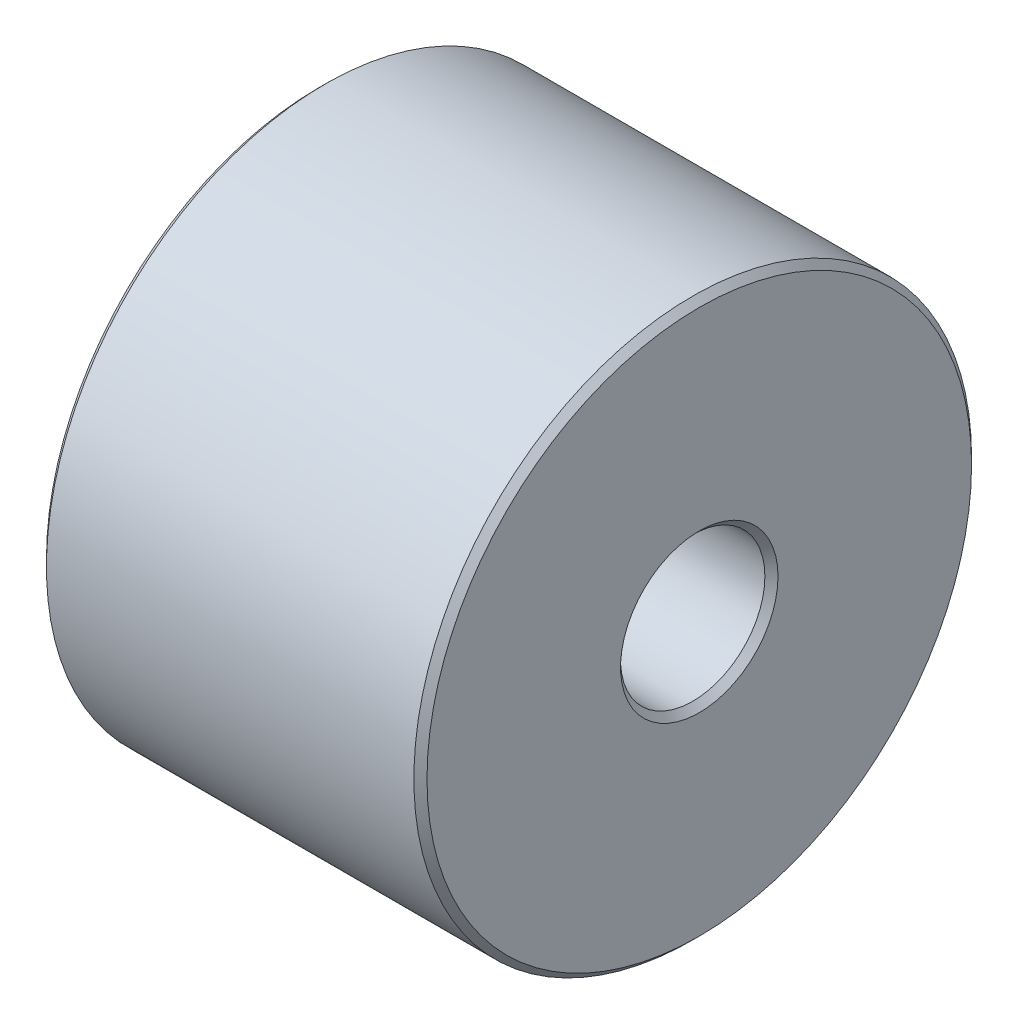
ISO-10303-21;
HEADER;
FILE_DESCRIPTION(('STEP AP214'),'2;1');
FILE_NAME('part.step','',(''),(''),'','','');
FILE_SCHEMA(('AUTOMOTIVE_DESIGN { 1 0 10303 214 1 1 1 1 }'));
ENDSEC;
DATA;
#1=APPLICATION_CONTEXT('core data for automotive mechanical design processes');
#2=APPLICATION_PROTOCOL_DEFINITION('international standard','automotive_design',2000,#1);
#3=PRODUCT_CONTEXT('',#1,'mechanical');
#4=PRODUCT('Part','Part','',(#3));
#5=PRODUCT_RELATED_PRODUCT_CATEGORY('part','',(#4));
#6=PRODUCT_DEFINITION_FORMATION('','',#4);
#7=PRODUCT_DEFINITION_CONTEXT('part definition',#1,'design');
#8=PRODUCT_DEFINITION('design','',#6,#7);
#9=PRODUCT_DEFINITION_SHAPE('','',#8);
#10=(LENGTH_UNIT() NAMED_UNIT(*) SI_UNIT(.MILLI.,.METRE.));
#11=(NAMED_UNIT(*) PLANE_ANGLE_UNIT() SI_UNIT($,.RADIAN.));
#12=(NAMED_UNIT(*) SI_UNIT($,.STERADIAN.) SOLID_ANGLE_UNIT());
#13=UNCERTAINTY_MEASURE_WITH_UNIT(LENGTH_MEASURE(1.E-05),#10,'distance_accuracy_value','');
#14=(GEOMETRIC_REPRESENTATION_CONTEXT(3) GLOBAL_UNCERTAINTY_ASSIGNED_CONTEXT((#13)) GLOBAL_UNIT_ASSIGNED_CONTEXT((#10,
#11,#12)) REPRESENTATION_CONTEXT('',''));
#15=CARTESIAN_POINT('',(0.,0.,0.));
#16=DIRECTION('',(0.,0.,1.));
#17=DIRECTION('',(1.,0.,0.));
#18=AXIS2_PLACEMENT_3D('',#15,#16,#17);
#19=CARTESIAN_POINT('',(11.6,0.,0.));
#20=DIRECTION('',(1.,0.,0.));
#21=DIRECTION('',(0.,0.,-1.));
#22=AXIS2_PLACEMENT_3D('',#19,#20,#21);
#23=PLANE('',#22);
#24=CARTESIAN_POINT('',(11.6,0.,0.));
#25=DIRECTION('',(1.,0.,0.));
#26=DIRECTION('',(0.,0.,-1.));
#27=AXIS2_PLACEMENT_3D('',#24,#25,#26);
#28=CIRCLE('',#27,8.3);
#29=CARTESIAN_POINT('',(11.6,0.,-8.3));
#30=VERTEX_POINT('',#29);
#31=EDGE_CURVE('E59',#30,#30,#28,.T.);
#32=ORIENTED_EDGE('',*,*,#31,.T.);
#33=EDGE_LOOP('',(#32));
#34=FACE_BOUND('',#33,.T.);
#35=CARTESIAN_POINT('',(11.6,0.,0.));
#36=DIRECTION('',(1.,0.,0.));
#37=DIRECTION('',(0.,0.,-1.));
#38=AXIS2_PLACEMENT_3D('',#35,#36,#37);
#39=CIRCLE('',#38,2.4);
#40=CARTESIAN_POINT('',(11.6,0.,-2.4));
#41=VERTEX_POINT('',#40);
#42=EDGE_CURVE('E62',#41,#41,#39,.F.);
#43=ORIENTED_EDGE('',*,*,#42,.T.);
#44=EDGE_LOOP('',(#43));
#45=FACE_BOUND('',#44,.T.);
#46=ADVANCED_FACE('F33',(#34,#45),#23,.T.);
#47=CARTESIAN_POINT('',(0.,0.,0.));
#48=DIRECTION('',(1.,0.,0.));
#49=DIRECTION('',(0.,0.,-1.));
#50=AXIS2_PLACEMENT_3D('',#47,#48,#49);
#51=PLANE('',#50);
#52=CARTESIAN_POINT('',(0.,0.,0.));
#53=DIRECTION('',(1.,0.,0.));
#54=DIRECTION('',(0.,0.,-1.));
#55=AXIS2_PLACEMENT_3D('',#52,#53,#54);
#56=CIRCLE('',#55,8.3);
#57=CARTESIAN_POINT('',(0.,0.,-8.3));
#58=VERTEX_POINT('',#57);
#59=EDGE_CURVE('E44',#58,#58,#56,.F.);
#60=ORIENTED_EDGE('',*,*,#59,.T.);
#61=EDGE_LOOP('',(#60));
#62=FACE_BOUND('',#61,.T.);
#63=CARTESIAN_POINT('',(0.,0.,0.));
#64=DIRECTION('',(1.,0.,0.));
#65=DIRECTION('',(0.,0.,-1.));
#66=AXIS2_PLACEMENT_3D('',#63,#64,#65);
#67=CIRCLE('',#66,2.4);
#68=CARTESIAN_POINT('',(0.,0.,-2.4));
#69=VERTEX_POINT('',#68);
#70=EDGE_CURVE('E48',#69,#69,#67,.T.);
#71=ORIENTED_EDGE('',*,*,#70,.T.);
#72=EDGE_LOOP('',(#71));
#73=FACE_BOUND('',#72,.T.);
#74=ADVANCED_FACE('F80',(#62,#73),#51,.F.);
#75=CARTESIAN_POINT('',(11.6,0.,0.));
#76=DIRECTION('',(-1.,0.,0.));
#77=DIRECTION('',(0.,0.,1.));
#78=AXIS2_PLACEMENT_3D('',#75,#76,#77);
#79=CYLINDRICAL_SURFACE('',#78,8.5);
#80=CARTESIAN_POINT('',(11.4,0.,0.));
#81=DIRECTION('',(1.,0.,0.));
#82=DIRECTION('',(0.,0.,-1.));
#83=AXIS2_PLACEMENT_3D('',#80,#81,#82);
#84=CIRCLE('',#83,8.5);
#85=CARTESIAN_POINT('',(11.4,0.,-8.5));
#86=VERTEX_POINT('',#85);
#87=EDGE_CURVE('E53',#86,#86,#84,.F.);
#88=ORIENTED_EDGE('',*,*,#87,.T.);
#89=EDGE_LOOP('',(#88));
#90=FACE_BOUND('',#89,.T.);
#91=CARTESIAN_POINT('',(0.200000000000001,0.,0.));
#92=DIRECTION('',(1.,0.,0.));
#93=DIRECTION('',(0.,0.,-1.));
#94=AXIS2_PLACEMENT_3D('',#91,#92,#93);
#95=CIRCLE('',#94,8.5);
#96=CARTESIAN_POINT('',(0.200000000000001,0.,-8.5));
#97=VERTEX_POINT('',#96);
#98=EDGE_CURVE('E56',#97,#97,#95,.T.);
#99=ORIENTED_EDGE('',*,*,#98,.T.);
#100=EDGE_LOOP('',(#99));
#101=FACE_BOUND('',#100,.T.);
#102=ADVANCED_FACE('F86',(#90,#101),#79,.T.);
#103=CARTESIAN_POINT('',(11.6,0.,0.));
#104=DIRECTION('',(-1.,0.,0.));
#105=DIRECTION('',(0.,0.,1.));
#106=AXIS2_PLACEMENT_3D('',#103,#104,#105);
#107=CYLINDRICAL_SURFACE('',#106,2.2);
#108=CARTESIAN_POINT('',(11.4,0.,0.));
#109=DIRECTION('',(1.,0.,0.));
#110=DIRECTION('',(0.,0.,-1.));
#111=AXIS2_PLACEMENT_3D('',#108,#109,#110);
#112=CIRCLE('',#111,2.2);
#113=CARTESIAN_POINT('',(11.4,0.,-2.2));
#114=VERTEX_POINT('',#113);
#115=EDGE_CURVE('E10',#114,#114,#112,.T.);
#116=ORIENTED_EDGE('',*,*,#115,.T.);
#117=EDGE_LOOP('',(#116));
#118=FACE_BOUND('',#117,.T.);
#119=CARTESIAN_POINT('',(0.200000000000002,0.,0.));
#120=DIRECTION('',(1.,0.,0.));
#121=DIRECTION('',(0.,0.,-1.));
#122=AXIS2_PLACEMENT_3D('',#119,#120,#121);
#123=CIRCLE('',#122,2.2);
#124=CARTESIAN_POINT('',(0.200000000000002,0.,-2.2));
#125=VERTEX_POINT('',#124);
#126=EDGE_CURVE('E40',#125,#125,#123,.F.);
#127=ORIENTED_EDGE('',*,*,#126,.T.);
#128=EDGE_LOOP('',(#127));
#129=FACE_BOUND('',#128,.T.);
#130=ADVANCED_FACE('F90',(#118,#129),#107,.F.);
#131=CARTESIAN_POINT('',(11.6,0.,0.));
#132=DIRECTION('',(-1.,0.,0.));
#133=DIRECTION('',(0.,0.,1.));
#134=AXIS2_PLACEMENT_3D('',#131,#132,#133);
#135=CONICAL_SURFACE('',#134,8.3,0.785398163397448);
#136=ORIENTED_EDGE('',*,*,#87,.F.);
#137=EDGE_LOOP('',(#136));
#138=FACE_BOUND('',#137,.T.);
#139=ORIENTED_EDGE('',*,*,#31,.F.);
#140=EDGE_LOOP('',(#139));
#141=FACE_BOUND('',#140,.T.);
#142=ADVANCED_FACE('F76',(#138,#141),#135,.T.);
#143=CARTESIAN_POINT('',(0.200000000000001,0.,0.));
#144=DIRECTION('',(1.,0.,0.));
#145=DIRECTION('',(0.,0.,-1.));
#146=AXIS2_PLACEMENT_3D('',#143,#144,#145);
#147=CONICAL_SURFACE('',#146,8.5,0.785398163397448);
#148=ORIENTED_EDGE('',*,*,#59,.F.);
#149=EDGE_LOOP('',(#148));
#150=FACE_BOUND('',#149,.T.);
#151=ORIENTED_EDGE('',*,*,#98,.F.);
#152=EDGE_LOOP('',(#151));
#153=FACE_BOUND('',#152,.T.);
#154=ADVANCED_FACE('F70',(#150,#153),#147,.T.);
#155=CARTESIAN_POINT('',(11.4,0.,0.));
#156=DIRECTION('',(1.,0.,0.));
#157=DIRECTION('',(0.,0.,-1.));
#158=AXIS2_PLACEMENT_3D('',#155,#156,#157);
#159=CONICAL_SURFACE('',#158,2.2,0.785398163397441);
#160=ORIENTED_EDGE('',*,*,#42,.F.);
#161=EDGE_LOOP('',(#160));
#162=FACE_BOUND('',#161,.T.);
#163=ORIENTED_EDGE('',*,*,#115,.F.);
#164=EDGE_LOOP('',(#163));
#165=FACE_BOUND('',#164,.T.);
#166=ADVANCED_FACE('F67',(#162,#165),#159,.F.);
#167=CARTESIAN_POINT('',(0.,0.,0.));
#168=DIRECTION('',(-1.,0.,0.));
#169=DIRECTION('',(0.,0.,1.));
#170=AXIS2_PLACEMENT_3D('',#167,#168,#169);
#171=CONICAL_SURFACE('',#170,2.4,0.785398163397441);
#172=ORIENTED_EDGE('',*,*,#126,.F.);
#173=EDGE_LOOP('',(#172));
#174=FACE_BOUND('',#173,.T.);
#175=ORIENTED_EDGE('',*,*,#70,.F.);
#176=EDGE_LOOP('',(#175));
#177=FACE_BOUND('',#176,.T.);
#178=ADVANCED_FACE('F35',(#174,#177),#171,.F.);
#179=CLOSED_SHELL('',(#46,#74,#102,#130,#142,#154,#166,#178));
#180=MANIFOLD_SOLID_BREP('B2',#179);
#181=ADVANCED_BREP_SHAPE_REPRESENTATION('',(#18,#180),#14);
#182=SHAPE_DEFINITION_REPRESENTATION(#9,#181);
ENDSEC;
END-ISO-10303-21;
